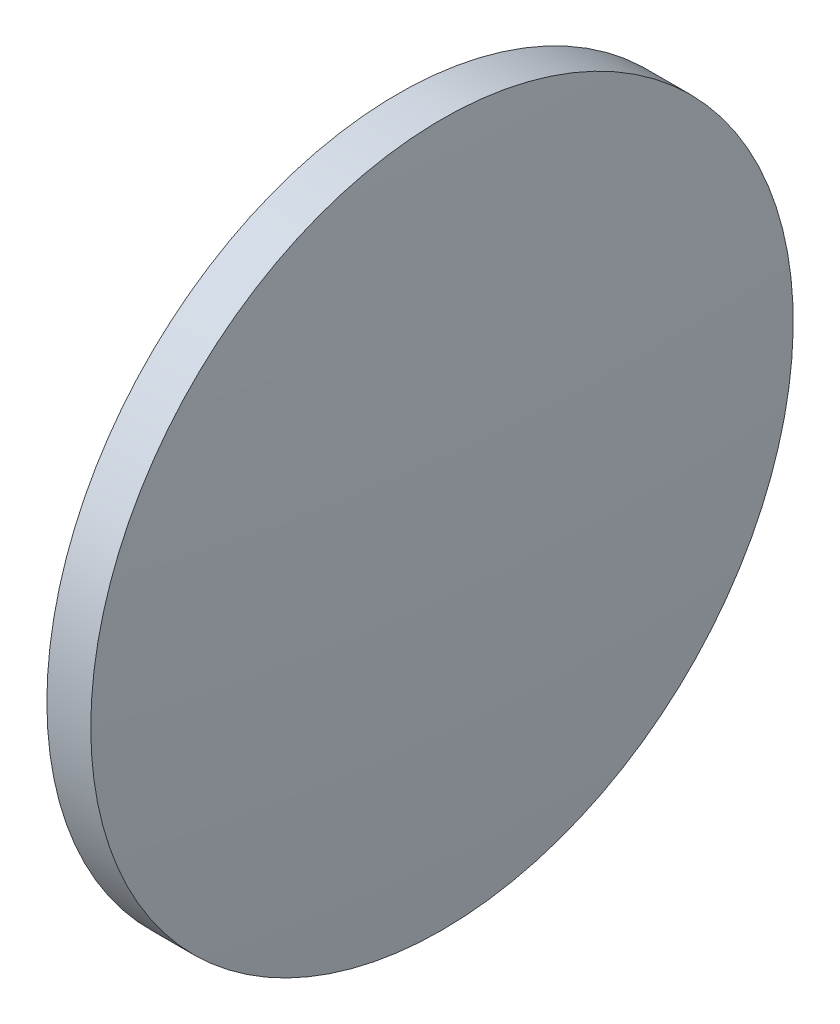
ISO-10303-21;
HEADER;
FILE_DESCRIPTION(('STEP AP214'),'2;1');
FILE_NAME('part.step','',(''),(''),'','','');
FILE_SCHEMA(('AUTOMOTIVE_DESIGN { 1 0 10303 214 1 1 1 1 }'));
ENDSEC;
DATA;
#1=APPLICATION_CONTEXT('core data for automotive mechanical design processes');
#2=APPLICATION_PROTOCOL_DEFINITION('international standard','automotive_design',2000,#1);
#3=PRODUCT_CONTEXT('',#1,'mechanical');
#4=PRODUCT('Part','Part','',(#3));
#5=PRODUCT_RELATED_PRODUCT_CATEGORY('part','',(#4));
#6=PRODUCT_DEFINITION_FORMATION('','',#4);
#7=PRODUCT_DEFINITION_CONTEXT('part definition',#1,'design');
#8=PRODUCT_DEFINITION('design','',#6,#7);
#9=PRODUCT_DEFINITION_SHAPE('','',#8);
#10=(LENGTH_UNIT() NAMED_UNIT(*) SI_UNIT(.MILLI.,.METRE.));
#11=(NAMED_UNIT(*) PLANE_ANGLE_UNIT() SI_UNIT($,.RADIAN.));
#12=(NAMED_UNIT(*) SI_UNIT($,.STERADIAN.) SOLID_ANGLE_UNIT());
#13=UNCERTAINTY_MEASURE_WITH_UNIT(LENGTH_MEASURE(1.E-05),#10,'distance_accuracy_value','');
#14=(GEOMETRIC_REPRESENTATION_CONTEXT(3) GLOBAL_UNCERTAINTY_ASSIGNED_CONTEXT((#13)) GLOBAL_UNIT_ASSIGNED_CONTEXT((#10,
#11,#12)) REPRESENTATION_CONTEXT('',''));
#15=CARTESIAN_POINT('',(0.,0.,0.));
#16=DIRECTION('',(0.,0.,1.));
#17=DIRECTION('',(1.,0.,0.));
#18=AXIS2_PLACEMENT_3D('',#15,#16,#17);
#19=CARTESIAN_POINT('',(310.555168822592,109.277527894266,0.));
#20=DIRECTION('',(-1.,0.,0.));
#21=DIRECTION('',(0.,-1.,0.));
#22=AXIS2_PLACEMENT_3D('',#19,#20,#21);
#23=SPHERICAL_SURFACE('',#22,256.800256410256);
#24=CARTESIAN_POINT('',(566.575425232848,109.277527894266,0.));
#25=DIRECTION('',(-1.,0.,0.));
#26=DIRECTION('',(0.,0.,1.));
#27=AXIS2_PLACEMENT_3D('',#24,#25,#26);
#28=CIRCLE('',#27,20.);
#29=CARTESIAN_POINT('',(566.575425232848,109.277527894266,20.));
#30=VERTEX_POINT('',#29);
#31=EDGE_CURVE('E10',#30,#30,#28,.T.);
#32=ORIENTED_EDGE('',*,*,#31,.F.);
#33=EDGE_LOOP('',(#32));
#34=FACE_BOUND('',#33,.T.);
#35=ADVANCED_FACE('F35',(#34),#23,.T.);
#36=CARTESIAN_POINT('',(554.568927913075,109.277527894266,0.));
#37=DIRECTION('',(-1.,0.,0.));
#38=DIRECTION('',(0.,0.,1.));
#39=AXIS2_PLACEMENT_3D('',#36,#37,#38);
#40=CYLINDRICAL_SURFACE('',#39,20.);
#41=CARTESIAN_POINT('',(564.075425232848,109.277527894266,0.));
#42=DIRECTION('',(-1.,0.,0.));
#43=DIRECTION('',(0.,0.,1.));
#44=AXIS2_PLACEMENT_3D('',#41,#42,#43);
#45=CIRCLE('',#44,20.);
#46=CARTESIAN_POINT('',(564.075425232848,109.277527894266,20.));
#47=VERTEX_POINT('',#46);
#48=EDGE_CURVE('E41',#47,#47,#45,.T.);
#49=ORIENTED_EDGE('',*,*,#48,.F.);
#50=EDGE_LOOP('',(#49));
#51=FACE_BOUND('',#50,.T.);
#52=ORIENTED_EDGE('',*,*,#31,.T.);
#53=EDGE_LOOP('',(#52));
#54=FACE_BOUND('',#53,.T.);
#55=ADVANCED_FACE('F49',(#51,#54),#40,.T.);
#56=CARTESIAN_POINT('',(564.075425232848,109.277527894266,0.));
#57=DIRECTION('',(1.,0.,0.));
#58=DIRECTION('',(0.,0.,-1.));
#59=AXIS2_PLACEMENT_3D('',#56,#57,#58);
#60=PLANE('',#59);
#61=ORIENTED_EDGE('',*,*,#48,.T.);
#62=EDGE_LOOP('',(#61));
#63=FACE_BOUND('',#62,.T.);
#64=ADVANCED_FACE('F47',(#63),#60,.F.);
#65=CLOSED_SHELL('',(#35,#55,#64));
#66=MANIFOLD_SOLID_BREP('B2',#65);
#67=ADVANCED_BREP_SHAPE_REPRESENTATION('',(#18,#66),#14);
#68=SHAPE_DEFINITION_REPRESENTATION(#9,#67);
ENDSEC;
END-ISO-10303-21;
